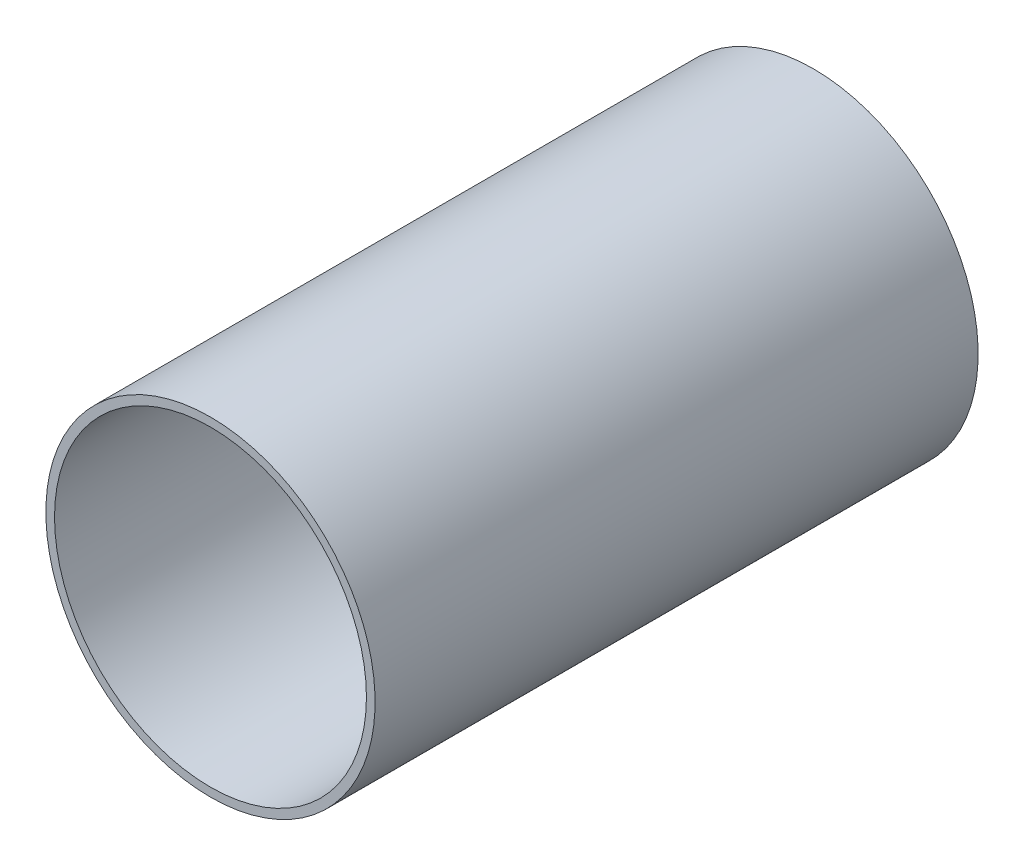
ISO-10303-21;
HEADER;
FILE_DESCRIPTION(('STEP AP214'),'2;1');
FILE_NAME('part.step','',(''),(''),'','','');
FILE_SCHEMA(('AUTOMOTIVE_DESIGN { 1 0 10303 214 1 1 1 1 }'));
ENDSEC;
DATA;
#1=APPLICATION_CONTEXT('core data for automotive mechanical design processes');
#2=APPLICATION_PROTOCOL_DEFINITION('international standard','automotive_design',2000,#1);
#3=PRODUCT_CONTEXT('',#1,'mechanical');
#4=PRODUCT('Part','Part','',(#3));
#5=PRODUCT_RELATED_PRODUCT_CATEGORY('part','',(#4));
#6=PRODUCT_DEFINITION_FORMATION('','',#4);
#7=PRODUCT_DEFINITION_CONTEXT('part definition',#1,'design');
#8=PRODUCT_DEFINITION('design','',#6,#7);
#9=PRODUCT_DEFINITION_SHAPE('','',#8);
#10=(LENGTH_UNIT() NAMED_UNIT(*) SI_UNIT(.MILLI.,.METRE.));
#11=(NAMED_UNIT(*) PLANE_ANGLE_UNIT() SI_UNIT($,.RADIAN.));
#12=(NAMED_UNIT(*) SI_UNIT($,.STERADIAN.) SOLID_ANGLE_UNIT());
#13=UNCERTAINTY_MEASURE_WITH_UNIT(LENGTH_MEASURE(1.E-05),#10,'distance_accuracy_value','');
#14=(GEOMETRIC_REPRESENTATION_CONTEXT(3) GLOBAL_UNCERTAINTY_ASSIGNED_CONTEXT((#13)) GLOBAL_UNIT_ASSIGNED_CONTEXT((#10,
#11,#12)) REPRESENTATION_CONTEXT('',''));
#15=CARTESIAN_POINT('',(0.,0.,0.));
#16=DIRECTION('',(0.,0.,1.));
#17=DIRECTION('',(1.,0.,0.));
#18=AXIS2_PLACEMENT_3D('',#15,#16,#17);
#19=CARTESIAN_POINT('',(177.26,-121.956,-0.045));
#20=DIRECTION('',(0.,0.,-1.));
#21=DIRECTION('',(0.,-1.,0.));
#22=AXIS2_PLACEMENT_3D('',#19,#20,#21);
#23=CYLINDRICAL_SURFACE('',#22,0.45);
#24=CARTESIAN_POINT('',(177.26,-121.956,-0.035));
#25=DIRECTION('',(0.,0.,-1.));
#26=DIRECTION('',(0.,-1.,0.));
#27=AXIS2_PLACEMENT_3D('',#24,#25,#26);
#28=CIRCLE('',#27,0.45);
#29=CARTESIAN_POINT('',(177.26,-122.406,-0.035));
#30=VERTEX_POINT('',#29);
#31=EDGE_CURVE('E64',#30,#30,#28,.T.);
#32=ORIENTED_EDGE('',*,*,#31,.T.);
#33=DIRECTION('',(0.,0.,1.));
#34=VECTOR('',#33,1.);
#35=CARTESIAN_POINT('',(177.26,-122.406,-0.045));
#36=LINE('',#35,#34);
#37=CARTESIAN_POINT('',(177.26,-122.406,1.705));
#38=VERTEX_POINT('',#37);
#39=EDGE_CURVE('E11',#30,#38,#36,.T.);
#40=ORIENTED_EDGE('',*,*,#39,.T.);
#41=CARTESIAN_POINT('',(177.26,-121.956,1.705));
#42=DIRECTION('',(0.,0.,-1.));
#43=DIRECTION('',(0.,-1.,0.));
#44=AXIS2_PLACEMENT_3D('',#41,#42,#43);
#45=CIRCLE('',#44,0.45);
#46=EDGE_CURVE('E26',#38,#38,#45,.T.);
#47=ORIENTED_EDGE('',*,*,#46,.F.);
#48=ORIENTED_EDGE('',*,*,#39,.F.);
#49=EDGE_LOOP('',(#32,#40,#47,#48));
#50=FACE_BOUND('',#49,.T.);
#51=ADVANCED_FACE('F17',(#50),#23,.F.);
#52=CARTESIAN_POINT('',(177.26,-122.431,1.705));
#53=DIRECTION('',(0.,0.,1.));
#54=DIRECTION('',(1.,0.,0.));
#55=AXIS2_PLACEMENT_3D('',#52,#53,#54);
#56=PLANE('',#55);
#57=ORIENTED_EDGE('',*,*,#46,.T.);
#58=EDGE_LOOP('',(#57));
#59=FACE_BOUND('',#58,.T.);
#60=CARTESIAN_POINT('',(177.26,-121.956,1.705));
#61=DIRECTION('',(0.,0.,1.));
#62=DIRECTION('',(0.,-1.,0.));
#63=AXIS2_PLACEMENT_3D('',#60,#61,#62);
#64=CIRCLE('',#63,0.475);
#65=CARTESIAN_POINT('',(177.26,-122.431,1.705));
#66=VERTEX_POINT('',#65);
#67=EDGE_CURVE('E46',#66,#66,#64,.T.);
#68=ORIENTED_EDGE('',*,*,#67,.T.);
#69=EDGE_LOOP('',(#68));
#70=FACE_BOUND('',#69,.T.);
#71=ADVANCED_FACE('F73',(#59,#70),#56,.T.);
#72=CARTESIAN_POINT('',(177.26,-122.431,-0.035));
#73=DIRECTION('',(0.,0.,1.));
#74=DIRECTION('',(1.,0.,0.));
#75=AXIS2_PLACEMENT_3D('',#72,#73,#74);
#76=PLANE('',#75);
#77=ORIENTED_EDGE('',*,*,#31,.F.);
#78=EDGE_LOOP('',(#77));
#79=FACE_BOUND('',#78,.T.);
#80=CARTESIAN_POINT('',(177.26,-121.956,-0.035));
#81=DIRECTION('',(0.,0.,1.));
#82=DIRECTION('',(0.,-1.,0.));
#83=AXIS2_PLACEMENT_3D('',#80,#81,#82);
#84=CIRCLE('',#83,0.475);
#85=CARTESIAN_POINT('',(177.26,-122.431,-0.035));
#86=VERTEX_POINT('',#85);
#87=EDGE_CURVE('E56',#86,#86,#84,.T.);
#88=ORIENTED_EDGE('',*,*,#87,.F.);
#89=EDGE_LOOP('',(#88));
#90=FACE_BOUND('',#89,.T.);
#91=ADVANCED_FACE('F76',(#79,#90),#76,.F.);
#92=CARTESIAN_POINT('',(177.26,-121.956,-0.035));
#93=DIRECTION('',(0.,0.,-1.));
#94=DIRECTION('',(0.,-1.,0.));
#95=AXIS2_PLACEMENT_3D('',#92,#93,#94);
#96=CYLINDRICAL_SURFACE('',#95,0.475);
#97=ORIENTED_EDGE('',*,*,#87,.T.);
#98=DIRECTION('',(0.,0.,1.));
#99=VECTOR('',#98,1.);
#100=CARTESIAN_POINT('',(177.26,-122.431,-0.035));
#101=LINE('',#100,#99);
#102=EDGE_CURVE('E53',#86,#66,#101,.T.);
#103=ORIENTED_EDGE('',*,*,#102,.T.);
#104=ORIENTED_EDGE('',*,*,#67,.F.);
#105=ORIENTED_EDGE('',*,*,#102,.F.);
#106=EDGE_LOOP('',(#97,#103,#104,#105));
#107=FACE_BOUND('',#106,.T.);
#108=ADVANCED_FACE('F54',(#107),#96,.T.);
#109=CLOSED_SHELL('',(#51,#71,#91,#108));
#110=MANIFOLD_SOLID_BREP('B1',#109);
#111=ADVANCED_BREP_SHAPE_REPRESENTATION('',(#18,#110),#14);
#112=SHAPE_DEFINITION_REPRESENTATION(#9,#111);
ENDSEC;
END-ISO-10303-21;
